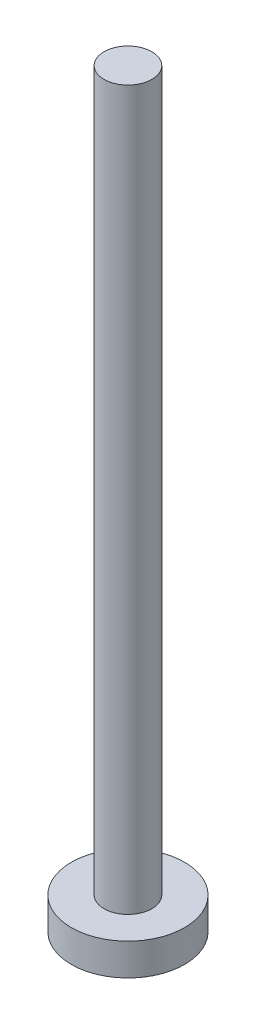
ISO-10303-21;
HEADER;
FILE_DESCRIPTION(('STEP AP214'),'2;1');
FILE_NAME('part.step','',(''),(''),'','','');
FILE_SCHEMA(('AUTOMOTIVE_DESIGN { 1 0 10303 214 1 1 1 1 }'));
ENDSEC;
DATA;
#1=APPLICATION_CONTEXT('core data for automotive mechanical design processes');
#2=APPLICATION_PROTOCOL_DEFINITION('international standard','automotive_design',2000,#1);
#3=PRODUCT_CONTEXT('',#1,'mechanical');
#4=PRODUCT('Part','Part','',(#3));
#5=PRODUCT_RELATED_PRODUCT_CATEGORY('part','',(#4));
#6=PRODUCT_DEFINITION_FORMATION('','',#4);
#7=PRODUCT_DEFINITION_CONTEXT('part definition',#1,'design');
#8=PRODUCT_DEFINITION('design','',#6,#7);
#9=PRODUCT_DEFINITION_SHAPE('','',#8);
#10=(LENGTH_UNIT() NAMED_UNIT(*) SI_UNIT(.MILLI.,.METRE.));
#11=(NAMED_UNIT(*) PLANE_ANGLE_UNIT() SI_UNIT($,.RADIAN.));
#12=(NAMED_UNIT(*) SI_UNIT($,.STERADIAN.) SOLID_ANGLE_UNIT());
#13=UNCERTAINTY_MEASURE_WITH_UNIT(LENGTH_MEASURE(1.E-05),#10,'distance_accuracy_value','');
#14=(GEOMETRIC_REPRESENTATION_CONTEXT(3) GLOBAL_UNCERTAINTY_ASSIGNED_CONTEXT((#13)) GLOBAL_UNIT_ASSIGNED_CONTEXT((#10,
#11,#12)) REPRESENTATION_CONTEXT('',''));
#15=CARTESIAN_POINT('',(0.,0.,0.));
#16=DIRECTION('',(0.,0.,1.));
#17=DIRECTION('',(1.,0.,0.));
#18=AXIS2_PLACEMENT_3D('',#15,#16,#17);
#19=CARTESIAN_POINT('',(0.,2.,0.));
#20=DIRECTION('',(0.,-1.,0.));
#21=DIRECTION('',(0.,0.,-1.));
#22=AXIS2_PLACEMENT_3D('',#19,#20,#21);
#23=CYLINDRICAL_SURFACE('',#22,3.55);
#24=CARTESIAN_POINT('',(0.,2.,0.));
#25=DIRECTION('',(0.,1.,0.));
#26=DIRECTION('',(0.,0.,1.));
#27=AXIS2_PLACEMENT_3D('',#24,#25,#26);
#28=CIRCLE('',#27,3.55);
#29=CARTESIAN_POINT('',(0.,2.,3.55));
#30=VERTEX_POINT('',#29);
#31=EDGE_CURVE('E10',#30,#30,#28,.T.);
#32=ORIENTED_EDGE('',*,*,#31,.F.);
#33=EDGE_LOOP('',(#32));
#34=FACE_BOUND('',#33,.T.);
#35=CARTESIAN_POINT('',(0.,0.,0.));
#36=DIRECTION('',(0.,1.,0.));
#37=DIRECTION('',(0.,0.,1.));
#38=AXIS2_PLACEMENT_3D('',#35,#36,#37);
#39=CIRCLE('',#38,3.55);
#40=CARTESIAN_POINT('',(0.,0.,3.55));
#41=VERTEX_POINT('',#40);
#42=EDGE_CURVE('E38',#41,#41,#39,.T.);
#43=ORIENTED_EDGE('',*,*,#42,.T.);
#44=EDGE_LOOP('',(#43));
#45=FACE_BOUND('',#44,.T.);
#46=ADVANCED_FACE('F35',(#34,#45),#23,.T.);
#47=CARTESIAN_POINT('',(0.,2.,0.));
#48=DIRECTION('',(0.,1.,0.));
#49=DIRECTION('',(0.,0.,1.));
#50=AXIS2_PLACEMENT_3D('',#47,#48,#49);
#51=PLANE('',#50);
#52=CARTESIAN_POINT('',(0.,2.,0.));
#53=DIRECTION('',(0.,1.,0.));
#54=DIRECTION('',(0.,0.,1.));
#55=AXIS2_PLACEMENT_3D('',#52,#53,#54);
#56=CIRCLE('',#55,1.5);
#57=CARTESIAN_POINT('',(0.,2.,1.5));
#58=VERTEX_POINT('',#57);
#59=EDGE_CURVE('E47',#58,#58,#56,.T.);
#60=ORIENTED_EDGE('',*,*,#59,.F.);
#61=EDGE_LOOP('',(#60));
#62=FACE_BOUND('',#61,.T.);
#63=ORIENTED_EDGE('',*,*,#31,.T.);
#64=EDGE_LOOP('',(#63));
#65=FACE_BOUND('',#64,.T.);
#66=ADVANCED_FACE('F62',(#62,#65),#51,.T.);
#67=CARTESIAN_POINT('',(0.,0.,0.));
#68=DIRECTION('',(0.,1.,0.));
#69=DIRECTION('',(0.,0.,1.));
#70=AXIS2_PLACEMENT_3D('',#67,#68,#69);
#71=PLANE('',#70);
#72=ORIENTED_EDGE('',*,*,#42,.F.);
#73=EDGE_LOOP('',(#72));
#74=FACE_BOUND('',#73,.T.);
#75=ADVANCED_FACE('F58',(#74),#71,.F.);
#76=CARTESIAN_POINT('',(0.,47.,0.));
#77=DIRECTION('',(0.,-1.,0.));
#78=DIRECTION('',(0.,0.,-1.));
#79=AXIS2_PLACEMENT_3D('',#76,#77,#78);
#80=CYLINDRICAL_SURFACE('',#79,1.5);
#81=CARTESIAN_POINT('',(0.,47.,0.));
#82=DIRECTION('',(0.,1.,0.));
#83=DIRECTION('',(0.,0.,1.));
#84=AXIS2_PLACEMENT_3D('',#81,#82,#83);
#85=CIRCLE('',#84,1.5);
#86=CARTESIAN_POINT('',(0.,47.,1.5));
#87=VERTEX_POINT('',#86);
#88=EDGE_CURVE('E45',#87,#87,#85,.T.);
#89=ORIENTED_EDGE('',*,*,#88,.F.);
#90=EDGE_LOOP('',(#89));
#91=FACE_BOUND('',#90,.T.);
#92=ORIENTED_EDGE('',*,*,#59,.T.);
#93=EDGE_LOOP('',(#92));
#94=FACE_BOUND('',#93,.T.);
#95=ADVANCED_FACE('F55',(#91,#94),#80,.T.);
#96=CARTESIAN_POINT('',(0.,47.,0.));
#97=DIRECTION('',(0.,1.,0.));
#98=DIRECTION('',(0.,0.,1.));
#99=AXIS2_PLACEMENT_3D('',#96,#97,#98);
#100=PLANE('',#99);
#101=ORIENTED_EDGE('',*,*,#88,.T.);
#102=EDGE_LOOP('',(#101));
#103=FACE_BOUND('',#102,.T.);
#104=ADVANCED_FACE('F53',(#103),#100,.T.);
#105=CLOSED_SHELL('',(#46,#66,#75,#95,#104));
#106=MANIFOLD_SOLID_BREP('B2',#105);
#107=ADVANCED_BREP_SHAPE_REPRESENTATION('',(#18,#106),#14);
#108=SHAPE_DEFINITION_REPRESENTATION(#9,#107);
ENDSEC;
END-ISO-10303-21;
